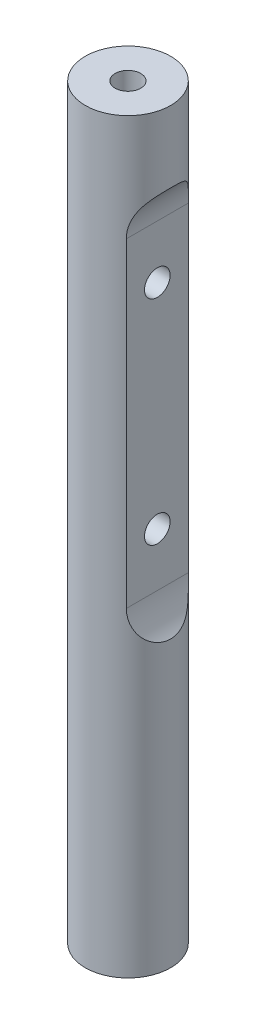
ISO-10303-21;
HEADER;
FILE_DESCRIPTION(('STEP AP214'),'2;1');
FILE_NAME('part.step','',(''),(''),'','','');
FILE_SCHEMA(('AUTOMOTIVE_DESIGN { 1 0 10303 214 1 1 1 1 }'));
ENDSEC;
DATA;
#1=APPLICATION_CONTEXT('core data for automotive mechanical design processes');
#2=APPLICATION_PROTOCOL_DEFINITION('international standard','automotive_design',2000,#1);
#3=PRODUCT_CONTEXT('',#1,'mechanical');
#4=PRODUCT('Part','Part','',(#3));
#5=PRODUCT_RELATED_PRODUCT_CATEGORY('part','',(#4));
#6=PRODUCT_DEFINITION_FORMATION('','',#4);
#7=PRODUCT_DEFINITION_CONTEXT('part definition',#1,'design');
#8=PRODUCT_DEFINITION('design','',#6,#7);
#9=PRODUCT_DEFINITION_SHAPE('','',#8);
#10=(LENGTH_UNIT() NAMED_UNIT(*) SI_UNIT(.MILLI.,.METRE.));
#11=(NAMED_UNIT(*) PLANE_ANGLE_UNIT() SI_UNIT($,.RADIAN.));
#12=(NAMED_UNIT(*) SI_UNIT($,.STERADIAN.) SOLID_ANGLE_UNIT());
#13=UNCERTAINTY_MEASURE_WITH_UNIT(LENGTH_MEASURE(1.E-05),#10,'distance_accuracy_value','');
#14=(GEOMETRIC_REPRESENTATION_CONTEXT(3) GLOBAL_UNCERTAINTY_ASSIGNED_CONTEXT((#13)) GLOBAL_UNIT_ASSIGNED_CONTEXT((#10,
#11,#12)) REPRESENTATION_CONTEXT('',''));
#15=CARTESIAN_POINT('',(0.,0.,0.));
#16=DIRECTION('',(0.,0.,1.));
#17=DIRECTION('',(1.,0.,0.));
#18=AXIS2_PLACEMENT_3D('',#15,#16,#17);
#19=CARTESIAN_POINT('',(0.,88.9,0.));
#20=DIRECTION('',(0.,-1.,0.));
#21=DIRECTION('',(0.,0.,-1.));
#22=AXIS2_PLACEMENT_3D('',#19,#20,#21);
#23=CYLINDRICAL_SURFACE('',#22,5.08);
#24=CARTESIAN_POINT('',(-5.08000000000001,68.326,0.));
#25=CARTESIAN_POINT('',(-5.07999928118559,68.3260010134447,-0.0836052305573521));
#26=CARTESIAN_POINT('',(-5.07791634345057,68.332902565442,-0.167220715445152));
#27=CARTESIAN_POINT('',(-5.0698105928319,68.3602608958897,-0.332016735309757));
#28=CARTESIAN_POINT('',(-5.06378660483927,68.3807217173517,-0.413196536482001));
#29=CARTESIAN_POINT('',(-5.04845881341866,68.4344539531808,-0.570720431078596));
#30=CARTESIAN_POINT('',(-5.03915985054432,68.4677064675329,-0.647071466225694));
#31=CARTESIAN_POINT('',(-5.01824862985448,68.5460006705448,-0.793114167949977));
#32=CARTESIAN_POINT('',(-5.0066360643514,68.5910439275138,-0.862804946949182));
#33=CARTESIAN_POINT('',(-4.98196348987859,68.6930035915922,-0.995549745938682));
#34=CARTESIAN_POINT('',(-4.96887381795549,68.7501968919001,-1.05838556038424));
#35=CARTESIAN_POINT('',(-4.9428992755781,68.8742429775888,-1.17373319658096));
#36=CARTESIAN_POINT('',(-4.93001443992094,68.941097385119,-1.22624328108679));
#37=CARTESIAN_POINT('',(-4.90559459817673,69.0844142850862,-1.32059718327286));
#38=CARTESIAN_POINT('',(-4.89409645170497,69.1610589963666,-1.36217465966568));
#39=CARTESIAN_POINT('',(-4.87419518320336,69.320653082298,-1.43176137091155));
#40=CARTESIAN_POINT('',(-4.86579131806324,69.4036009374308,-1.45977386398692));
#41=CARTESIAN_POINT('',(-4.8533392477185,69.5709965103886,-1.50064859821573));
#42=CARTESIAN_POINT('',(-4.84917566433726,69.6553371877658,-1.51391311374431));
#43=CARTESIAN_POINT('',(-4.84533234385764,69.8251416867163,-1.52617150304506));
#44=CARTESIAN_POINT('',(-4.84565152036741,69.910605231148,-1.52516883445255));
#45=CARTESIAN_POINT('',(-4.85063539972863,70.0769580511462,-1.50923728835008));
#46=CARTESIAN_POINT('',(-4.85514282816727,70.157901086368,-1.49481240546887));
#47=CARTESIAN_POINT('',(-4.86774089928282,70.3161609028539,-1.45326019153888));
#48=CARTESIAN_POINT('',(-4.87583189558469,70.3934773254123,-1.42613160687906));
#49=CARTESIAN_POINT('',(-4.89481096804173,70.5435219552553,-1.3595708308014));
#50=CARTESIAN_POINT('',(-4.90573584373808,70.6161727972985,-1.31997518005596));
#51=CARTESIAN_POINT('',(-4.92913402792066,70.7539677343624,-1.22971786150102));
#52=CARTESIAN_POINT('',(-4.94160771134943,70.8191100042844,-1.17905351186629));
#53=CARTESIAN_POINT('',(-4.96733587478704,70.9428971698142,-1.06559391417795));
#54=CARTESIAN_POINT('',(-4.98060120779466,71.0011571226541,-1.00238042598645));
#55=CARTESIAN_POINT('',(-5.00595639968271,71.1063388478093,-0.866915471462994));
#56=CARTESIAN_POINT('',(-5.01804618454705,71.153259906469,-0.794663436690661));
#57=CARTESIAN_POINT('',(-5.03979850630582,71.2346656812242,-0.642472718956282));
#58=CARTESIAN_POINT('',(-5.04944424367007,71.2690649965099,-0.562485793743911));
#59=CARTESIAN_POINT('',(-5.06510058181538,71.3238091835412,-0.397505342253167));
#60=CARTESIAN_POINT('',(-5.07111219645991,71.344157975389,-0.312513219615005));
#61=CARTESIAN_POINT('',(-5.07866258477835,71.3695826127458,-0.143207478551014));
#62=CARTESIAN_POINT('',(-5.08035408024475,71.3751801711744,-0.0589788991627962));
#63=CARTESIAN_POINT('',(-5.07952170013628,71.3724057377965,0.109219599516565));
#64=CARTESIAN_POINT('',(-5.07699838728601,71.3640356108341,0.193189551837839));
#65=CARTESIAN_POINT('',(-5.06811988138957,71.3339852351107,0.356518062994658));
#66=CARTESIAN_POINT('',(-5.06185251076207,71.3126098382178,0.435937936976004));
#67=CARTESIAN_POINT('',(-5.04621137406997,71.2575224754974,0.590046713177801));
#68=CARTESIAN_POINT('',(-5.03683723462222,71.2238090267855,0.664735045457996));
#69=CARTESIAN_POINT('',(-5.01568368820946,71.1441267838712,0.809180184492427));
#70=CARTESIAN_POINT('',(-5.0038536532295,71.0978925095968,0.87878292741886));
#71=CARTESIAN_POINT('',(-4.97914644264547,70.9948036498823,1.00941968090783));
#72=CARTESIAN_POINT('',(-4.96626900501977,70.9379464023221,1.07045153687363));
#73=CARTESIAN_POINT('',(-4.94033222619044,70.8127744946968,1.18451116463843));
#74=CARTESIAN_POINT('',(-4.927283262338,70.7441187342159,1.23716776931206));
#75=CARTESIAN_POINT('',(-4.90297739482279,70.5986620139623,1.33023858993307));
#76=CARTESIAN_POINT('',(-4.89172044417126,70.5218612678489,1.37065312690742));
#77=CARTESIAN_POINT('',(-4.87240264648896,70.3625389888852,1.43781624681202));
#78=CARTESIAN_POINT('',(-4.86432695249328,70.2800461944788,1.46462848488042));
#79=CARTESIAN_POINT('',(-4.85233059872599,70.1114290235656,1.50390078508155));
#80=CARTESIAN_POINT('',(-4.84840851508433,70.0253059020797,1.51636576562439));
#81=CARTESIAN_POINT('',(-4.84530372056024,69.8557286973298,1.52625536236819));
#82=CARTESIAN_POINT('',(-4.84593033801839,69.7723129305661,1.52428504193425));
#83=CARTESIAN_POINT('',(-4.85139391708907,69.6070600709732,1.5068042553193));
#84=CARTESIAN_POINT('',(-4.85623071010032,69.5252229150608,1.49129433134711));
#85=CARTESIAN_POINT('',(-4.86944175889112,69.3664394744709,1.44756519025001));
#86=CARTESIAN_POINT('',(-4.877771342187,69.2894450760405,1.41950618315181));
#87=CARTESIAN_POINT('',(-4.89702123371683,69.1411952821612,1.35160011235066));
#88=CARTESIAN_POINT('',(-4.90794203773421,69.069940988477,1.31175079242281));
#89=CARTESIAN_POINT('',(-4.93164039248647,68.9323862736085,1.21969544025952));
#90=CARTESIAN_POINT('',(-4.94447108806419,68.8663608585594,1.16709216510481));
#91=CARTESIAN_POINT('',(-4.97028541577226,68.7438782617192,1.05173713583857));
#92=CARTESIAN_POINT('',(-4.98326908677088,68.6874235703008,0.988982748608641));
#93=CARTESIAN_POINT('',(-5.0083815155578,68.5840402131083,0.852897214378164));
#94=CARTESIAN_POINT('',(-5.02047418321925,68.5374382899948,0.77931049196324));
#95=CARTESIAN_POINT('',(-5.04200851343106,68.4573330673775,0.624983635967253));
#96=CARTESIAN_POINT('',(-5.05145141529964,68.4238236415131,0.544246869846932));
#97=CARTESIAN_POINT('',(-5.0657980976881,68.3738583999368,0.386849836057765));
#98=CARTESIAN_POINT('',(-5.07107979819164,68.3559601403506,0.3106795533455));
#99=CARTESIAN_POINT('',(-5.07818079606404,68.3320314583546,0.15634227835447));
#100=CARTESIAN_POINT('',(-5.08000067213217,68.3259990523719,0.0781756220158688));
#101=CARTESIAN_POINT('',(-5.08000000000001,68.326,0.));
#102=B_SPLINE_CURVE_WITH_KNOTS('',3,(#24,#25,#26,#27,#28,#29,#30,#31,#32,#33,#34,#35,#36,#37,
#38,#39,#40,#41,#42,#43,#44,#45,#46,#47,#48,#49,#50,#51,#52,#53,#54,#55,#56,#57,#58,#59,#60,#61,
#62,#63,#64,#65,#66,#67,#68,#69,#70,#71,#72,#73,#74,#75,#76,#77,#78,#79,#80,#81,#82,#83,#84,#85,
#86,#87,#88,#89,#90,#91,#92,#93,#94,#95,#96,#97,#98,#99,#100,#101),.UNSPECIFIED.,.T.,.F.,(4,2,2,
2,2,2,2,2,2,2,2,2,2,2,2,2,2,2,2,2,2,2,2,2,2,2,2,2,2,2,2,2,2,2,2,2,2,2,4),(0.,0.25052853487041,
0.501131804283533,0.751366215121684,1.0016339270433,1.25837292595362,1.5151550828525,
1.77771024700173,2.04020231575914,2.29534404386304,2.55042393972194,2.79629632964838,
3.04219298756527,3.29145825270271,3.54078397921089,3.80052177712934,4.06027591835566,
4.32176983631793,4.58319076785267,4.8352335038956,5.08724259207129,5.33356054629242,
5.57990811467226,5.83195486594152,6.08406486512191,6.34533046727978,6.6065892176072,
6.86661379990468,7.12654921611644,7.37565357954409,7.6247479677618,7.8707492104916,
8.11679755913952,8.37180876490804,8.62688622495859,8.88942084095173,9.15183246180754,
9.38612999001342,9.62038834820051),.UNSPECIFIED.);
#103=CARTESIAN_POINT('',(-5.08000000000001,68.326,0.));
#104=VERTEX_POINT('',#103);
#105=EDGE_CURVE('E13',#104,#104,#102,.T.);
#106=ORIENTED_EDGE('',*,*,#105,.T.);
#107=EDGE_LOOP('',(#106));
#108=FACE_BOUND('',#107,.T.);
#109=CARTESIAN_POINT('',(-5.08000000000001,42.926,0.));
#110=CARTESIAN_POINT('',(-5.07999928118559,42.9260010134447,-0.0836052305573519));
#111=CARTESIAN_POINT('',(-5.07791634345057,42.932902565442,-0.167220715445152));
#112=CARTESIAN_POINT('',(-5.0698105928319,42.9602608958897,-0.332016735309756));
#113=CARTESIAN_POINT('',(-5.06378660483927,42.9807217173517,-0.413196536481999));
#114=CARTESIAN_POINT('',(-5.04845881341866,43.0344539531808,-0.570720431078596));
#115=CARTESIAN_POINT('',(-5.03915985054432,43.0677064675329,-0.647071466225696));
#116=CARTESIAN_POINT('',(-5.01824862985448,43.1460006705447,-0.793114167949977));
#117=CARTESIAN_POINT('',(-5.0066360643514,43.1910439275138,-0.862804946949177));
#118=CARTESIAN_POINT('',(-4.98196348987859,43.2930035915922,-0.995549745938677));
#119=CARTESIAN_POINT('',(-4.96887381795549,43.3501968919001,-1.05838556038424));
#120=CARTESIAN_POINT('',(-4.94289927557809,43.4742429775888,-1.17373319658096));
#121=CARTESIAN_POINT('',(-4.93001443992094,43.541097385119,-1.22624328108679));
#122=CARTESIAN_POINT('',(-4.90559459817673,43.6844142850862,-1.32059718327286));
#123=CARTESIAN_POINT('',(-4.89409645170497,43.7610589963666,-1.36217465966568));
#124=CARTESIAN_POINT('',(-4.87419518320336,43.920653082298,-1.43176137091156));
#125=CARTESIAN_POINT('',(-4.86579131806324,44.0036009374308,-1.45977386398692));
#126=CARTESIAN_POINT('',(-4.85333924771849,44.1709965103885,-1.50064859821573));
#127=CARTESIAN_POINT('',(-4.84917566433726,44.2553371877658,-1.51391311374431));
#128=CARTESIAN_POINT('',(-4.84533234385764,44.4251416867162,-1.52617150304506));
#129=CARTESIAN_POINT('',(-4.84565152036741,44.510605231148,-1.52516883445255));
#130=CARTESIAN_POINT('',(-4.85063539972862,44.6769580511462,-1.50923728835008));
#131=CARTESIAN_POINT('',(-4.85514282816727,44.757901086368,-1.49481240546887));
#132=CARTESIAN_POINT('',(-4.86774089928282,44.9161609028538,-1.45326019153888));
#133=CARTESIAN_POINT('',(-4.87583189558468,44.9934773254123,-1.42613160687906));
#134=CARTESIAN_POINT('',(-4.89481096804173,45.1435219552553,-1.3595708308014));
#135=CARTESIAN_POINT('',(-4.90573584373807,45.2161727972985,-1.31997518005596));
#136=CARTESIAN_POINT('',(-4.92913402792066,45.3539677343623,-1.22971786150102));
#137=CARTESIAN_POINT('',(-4.94160771134943,45.4191100042844,-1.1790535118663));
#138=CARTESIAN_POINT('',(-4.96733587478704,45.5428971698142,-1.06559391417795));
#139=CARTESIAN_POINT('',(-4.98060120779466,45.6011571226541,-1.00238042598644));
#140=CARTESIAN_POINT('',(-5.00595639968271,45.7063388478093,-0.866915471462987));
#141=CARTESIAN_POINT('',(-5.01804618454705,45.7532599064691,-0.79466343669066));
#142=CARTESIAN_POINT('',(-5.03979850630582,45.8346656812242,-0.642472718956287));
#143=CARTESIAN_POINT('',(-5.04944424367007,45.8690649965099,-0.562485793743917));
#144=CARTESIAN_POINT('',(-5.06510058181538,45.9238091835412,-0.397505342253176));
#145=CARTESIAN_POINT('',(-5.07111219645991,45.944157975389,-0.312513219615016));
#146=CARTESIAN_POINT('',(-5.07866258477835,45.9695826127458,-0.143207478551028));
#147=CARTESIAN_POINT('',(-5.08035408024475,45.9751801711744,-0.0589788991628086));
#148=CARTESIAN_POINT('',(-5.07952170013628,45.9724057377965,0.109219599516554));
#149=CARTESIAN_POINT('',(-5.07699838728601,45.9640356108341,0.193189551837829));
#150=CARTESIAN_POINT('',(-5.06811988138957,45.9339852351107,0.356518062994648));
#151=CARTESIAN_POINT('',(-5.06185251076207,45.9126098382178,0.435937936975993));
#152=CARTESIAN_POINT('',(-5.04621137406997,45.8575224754973,0.59004671317779));
#153=CARTESIAN_POINT('',(-5.03683723462222,45.8238090267855,0.664735045457988));
#154=CARTESIAN_POINT('',(-5.01568368820946,45.7441267838712,0.809180184492422));
#155=CARTESIAN_POINT('',(-5.0038536532295,45.6978925095969,0.878782927418856));
#156=CARTESIAN_POINT('',(-4.97914644264547,45.5948036498823,1.00941968090782));
#157=CARTESIAN_POINT('',(-4.96626900501977,45.5379464023221,1.07045153687362));
#158=CARTESIAN_POINT('',(-4.94033222619044,45.4127744946967,1.18451116463843));
#159=CARTESIAN_POINT('',(-4.927283262338,45.3441187342159,1.23716776931207));
#160=CARTESIAN_POINT('',(-4.90297739482279,45.1986620139622,1.33023858993307));
#161=CARTESIAN_POINT('',(-4.89172044417126,45.1218612678489,1.37065312690743));
#162=CARTESIAN_POINT('',(-4.87240264648896,44.9625389888852,1.43781624681202));
#163=CARTESIAN_POINT('',(-4.86432695249328,44.8800461944788,1.46462848488042));
#164=CARTESIAN_POINT('',(-4.85233059872599,44.7114290235656,1.50390078508155));
#165=CARTESIAN_POINT('',(-4.84840851508434,44.6253059020797,1.51636576562439));
#166=CARTESIAN_POINT('',(-4.84530372056025,44.4557286973298,1.52625536236819));
#167=CARTESIAN_POINT('',(-4.84593033801839,44.3723129305661,1.52428504193425));
#168=CARTESIAN_POINT('',(-4.85139391708907,44.2070600709732,1.50680425531929));
#169=CARTESIAN_POINT('',(-4.85623071010032,44.1252229150608,1.4912943313471));
#170=CARTESIAN_POINT('',(-4.86944175889112,43.9664394744709,1.44756519025001));
#171=CARTESIAN_POINT('',(-4.877771342187,43.8894450760405,1.41950618315181));
#172=CARTESIAN_POINT('',(-4.89702123371683,43.7411952821612,1.35160011235066));
#173=CARTESIAN_POINT('',(-4.90794203773421,43.669940988477,1.31175079242281));
#174=CARTESIAN_POINT('',(-4.93164039248646,43.5323862736085,1.21969544025952));
#175=CARTESIAN_POINT('',(-4.94447108806419,43.4663608585594,1.16709216510481));
#176=CARTESIAN_POINT('',(-4.97028541577226,43.3438782617192,1.05173713583858));
#177=CARTESIAN_POINT('',(-4.98326908677088,43.2874235703008,0.988982748608645));
#178=CARTESIAN_POINT('',(-5.00838151555779,43.1840402131083,0.852897214378173));
#179=CARTESIAN_POINT('',(-5.02047418321925,43.1374382899948,0.779310491963251));
#180=CARTESIAN_POINT('',(-5.04200851343106,43.0573330673775,0.624983635967263));
#181=CARTESIAN_POINT('',(-5.05145141529964,43.0238236415131,0.544246869846937));
#182=CARTESIAN_POINT('',(-5.0657980976881,42.9738583999368,0.386849836057765));
#183=CARTESIAN_POINT('',(-5.07107979819165,42.9559601403506,0.310679553345501));
#184=CARTESIAN_POINT('',(-5.07818079606404,42.9320314583546,0.156342278354471));
#185=CARTESIAN_POINT('',(-5.08000067213216,42.9259990523719,0.0781756220158694));
#186=CARTESIAN_POINT('',(-5.08000000000001,42.926,0.));
#187=B_SPLINE_CURVE_WITH_KNOTS('',3,(#109,#110,#111,#112,#113,#114,#115,#116,#117,#118,#119,
#120,#121,#122,#123,#124,#125,#126,#127,#128,#129,#130,#131,#132,#133,#134,#135,#136,#137,#138,
#139,#140,#141,#142,#143,#144,#145,#146,#147,#148,#149,#150,#151,#152,#153,#154,#155,#156,#157,
#158,#159,#160,#161,#162,#163,#164,#165,#166,#167,#168,#169,#170,#171,#172,#173,#174,#175,#176,
#177,#178,#179,#180,#181,#182,#183,#184,#185,#186),.UNSPECIFIED.,.T.,.F.,(4,2,2,2,2,2,2,2,2,2,2,
2,2,2,2,2,2,2,2,2,2,2,2,2,2,2,2,2,2,2,2,2,2,2,2,2,2,2,4),(0.,0.25052853487041,0.501131804283531,
0.751366215121685,1.0016339270433,1.25837292595362,1.5151550828525,1.77771024700174,
2.04020231575913,2.29534404386303,2.55042393972193,2.79629632964837,3.04219298756527,
3.29145825270271,3.54078397921089,3.80052177712935,4.06027591835566,4.32176983631793,
4.58319076785265,4.83523350389558,5.08724259207129,5.33356054629241,5.57990811467224,
5.83195486594151,6.0840648651219,6.3453304672798,6.60658921760719,6.86661379990468,
7.12654921611643,7.3756535795441,7.62474796776181,7.87074921049159,8.11679755913952,
8.37180876490804,8.62688622495857,8.88942084095171,9.15183246180753,9.38612999001341,
9.6203883482005),.UNSPECIFIED.);
#188=CARTESIAN_POINT('',(-5.08000000000001,42.926,0.));
#189=VERTEX_POINT('',#188);
#190=EDGE_CURVE('E62',#189,#189,#187,.T.);
#191=ORIENTED_EDGE('',*,*,#190,.T.);
#192=EDGE_LOOP('',(#191));
#193=FACE_BOUND('',#192,.T.);
#194=CARTESIAN_POINT('',(0.,0.,0.));
#195=DIRECTION('',(0.,1.,0.));
#196=DIRECTION('',(0.,0.,1.));
#197=AXIS2_PLACEMENT_3D('',#194,#195,#196);
#198=CIRCLE('',#197,5.08);
#199=CARTESIAN_POINT('',(0.,0.,5.08));
#200=VERTEX_POINT('',#199);
#201=EDGE_CURVE('E161',#200,#200,#198,.T.);
#202=ORIENTED_EDGE('',*,*,#201,.T.);
#203=EDGE_LOOP('',(#202));
#204=FACE_BOUND('',#203,.T.);
#205=CARTESIAN_POINT('',(0.,88.9,0.));
#206=DIRECTION('',(0.,1.,0.));
#207=DIRECTION('',(0.,0.,1.));
#208=AXIS2_PLACEMENT_3D('',#205,#206,#207);
#209=CIRCLE('',#208,5.08);
#210=CARTESIAN_POINT('',(0.,88.9,5.08));
#211=VERTEX_POINT('',#210);
#212=EDGE_CURVE('E91',#211,#211,#209,.T.);
#213=ORIENTED_EDGE('',*,*,#212,.F.);
#214=EDGE_LOOP('',(#213));
#215=FACE_BOUND('',#214,.T.);
#216=CARTESIAN_POINT('',(3.4925,38.1,3.68901663726256));
#217=CARTESIAN_POINT('',(3.49248002010246,37.9779684983372,3.68899434683154));
#218=CARTESIAN_POINT('',(3.49601699210803,37.8559317980734,3.68568549951045));
#219=CARTESIAN_POINT('',(3.51006535485599,37.6125990551638,3.67233123001832));
#220=CARTESIAN_POINT('',(3.52057860595572,37.4913032187932,3.6622840109248));
#221=CARTESIAN_POINT('',(3.54850047058183,37.2497452141904,3.6352306912495));
#222=CARTESIAN_POINT('',(3.56593886542265,37.1294898331607,3.61819452437162));
#223=CARTESIAN_POINT('',(3.60740861825911,36.8913930721754,3.57685140164994));
#224=CARTESIAN_POINT('',(3.63143950303185,36.7735515196023,3.55254496767001));
#225=CARTESIAN_POINT('',(3.68572606694843,36.5408512107284,3.49619165828006));
#226=CARTESIAN_POINT('',(3.71599769324276,36.4260009621964,3.4641249154837));
#227=CARTESIAN_POINT('',(3.78210520760592,36.2005498503639,3.39182526613429));
#228=CARTESIAN_POINT('',(3.81794064036449,36.0899486402692,3.35159302771625));
#229=CARTESIAN_POINT('',(3.89428416220474,35.8741743407115,3.26257272569786));
#230=CARTESIAN_POINT('',(3.93478349094456,35.7689915947761,3.21380061589724));
#231=CARTESIAN_POINT('',(4.01946434815094,35.5648545091605,3.10723895982833));
#232=CARTESIAN_POINT('',(4.06364550901865,35.4658995494175,3.04945031328134));
#233=CARTESIAN_POINT('',(4.15163203129862,35.2810730270066,2.92841200276997));
#234=CARTESIAN_POINT('',(4.19529391750769,35.1947712021983,2.86571547651936));
#235=CARTESIAN_POINT('',(4.28352459699651,35.0293191165464,2.73207306974154));
#236=CARTESIAN_POINT('',(4.32809325521431,34.9501678000655,2.66112841044353));
#237=CARTESIAN_POINT('',(4.41679470014537,34.7997199180533,2.51115683415549));
#238=CARTESIAN_POINT('',(4.46092764529205,34.7284203939189,2.43213298324817));
#239=CARTESIAN_POINT('',(4.5473869156324,34.5941972523549,2.26636345455124));
#240=CARTESIAN_POINT('',(4.58971348034978,34.5312725220796,2.17961880526565));
#241=CARTESIAN_POINT('',(4.66597656494355,34.4216883527399,2.01060334865437));
#242=CARTESIAN_POINT('',(4.70029328934269,34.3739779002837,1.92918287213759));
#243=CARTESIAN_POINT('',(4.76567796850873,34.2853688407207,1.76147941895235));
#244=CARTESIAN_POINT('',(4.79674620938263,34.2444696335319,1.67519687153784));
#245=CARTESIAN_POINT('',(4.85487731673975,34.1695585881304,1.49840727989453));
#246=CARTESIAN_POINT('',(4.88194053400598,34.135546146639,1.40790060655343));
#247=CARTESIAN_POINT('',(4.93142160689446,34.0744121776143,1.22335831107777));
#248=CARTESIAN_POINT('',(4.95383953430798,34.0472905435847,1.12932274350753));
#249=CARTESIAN_POINT('',(4.99237878046166,34.0012596199339,0.943928784273773));
#250=CARTESIAN_POINT('',(5.00878646847974,33.9819699363696,0.852723957656833));
#251=CARTESIAN_POINT('',(5.03668877855218,33.9494411550742,0.668468686853424));
#252=CARTESIAN_POINT('',(5.04818177508254,33.9362040591237,0.575417642665918));
#253=CARTESIAN_POINT('',(5.06601748362316,33.9157558602437,0.388207469405466));
#254=CARTESIAN_POINT('',(5.07236234882509,33.9085422379762,0.2940488203195));
#255=CARTESIAN_POINT('',(5.07978929859174,33.9001049337951,0.105221675713226));
#256=CARTESIAN_POINT('',(5.08086943225363,33.89888347234,0.0105530042056567));
#257=CARTESIAN_POINT('',(5.0777452480888,33.9024271809663,-0.178326191269714));
#258=CARTESIAN_POINT('',(5.07355533878085,33.9071760279571,-0.272537260534924));
#259=CARTESIAN_POINT('',(5.05999308206518,33.9226523649694,-0.460126648395613));
#260=CARTESIAN_POINT('',(5.0506188337251,33.9333820479847,-0.55350464876217));
#261=CARTESIAN_POINT('',(5.02687316700223,33.9608494701557,-0.738685344048326));
#262=CARTESIAN_POINT('',(5.01250401695501,33.9775844822216,-0.830488734221502));
#263=CARTESIAN_POINT('',(4.97904493989152,34.017111935655,-1.0119415749284));
#264=CARTESIAN_POINT('',(4.95995329191027,34.0399065854924,-1.10159022713997));
#265=CARTESIAN_POINT('',(4.9174531575804,34.0915676042718,-1.27799835834299));
#266=CARTESIAN_POINT('',(4.89404773845387,34.1204296611407,-1.36475983877751));
#267=CARTESIAN_POINT('',(4.84338875774374,34.1842565173886,-1.53488332629156));
#268=CARTESIAN_POINT('',(4.81613380250331,34.2192235280461,-1.61824408805156));
#269=CARTESIAN_POINT('',(4.75837383590255,34.2952092052174,-1.78093279588234));
#270=CARTESIAN_POINT('',(4.72787056116598,34.3362246425764,-1.86026286367374));
#271=CARTESIAN_POINT('',(4.66426259747171,34.4242261645108,-2.01445451214799));
#272=CARTESIAN_POINT('',(4.63115695710554,34.4712144366272,-2.08931444081068));
#273=CARTESIAN_POINT('',(4.52883979435764,34.6211888144077,-2.30686871074253));
#274=CARTESIAN_POINT('',(4.45673345508036,34.7330514219671,-2.44225096977255));
#275=CARTESIAN_POINT('',(4.31111608724529,34.9780483723542,-2.69101450492152));
#276=CARTESIAN_POINT('',(4.23760486068993,35.1111857332926,-2.80439265439934));
#277=CARTESIAN_POINT('',(4.09149391081804,35.4025533915976,-3.01383326781392));
#278=CARTESIAN_POINT('',(4.01911242230822,35.5616892004926,-3.1087853216842));
#279=CARTESIAN_POINT('',(3.88461743404587,35.8957720413072,-3.27530853847656));
#280=CARTESIAN_POINT('',(3.82251141022207,36.0707304430916,-3.34686271487384));
#281=CARTESIAN_POINT('',(3.70625587466038,36.4527946507853,-3.47540664517467));
#282=CARTESIAN_POINT('',(3.65382305138529,36.6612906184652,-3.52980262397758));
#283=CARTESIAN_POINT('',(3.57004953464807,37.0871173279033,-3.61451433919406));
#284=CARTESIAN_POINT('',(3.5386997027269,37.304444198518,-3.64484050973615));
#285=CARTESIAN_POINT('',(3.50998973376064,37.6192749493296,-3.67239414137797));
#286=CARTESIAN_POINT('',(3.50343082091988,37.7153062597603,-3.67864332101859));
#287=CARTESIAN_POINT('',(3.494690023345,37.9075478585633,-3.68694590869129));
#288=CARTESIAN_POINT('',(3.49249903124456,38.0037573549942,-3.68900804711191));
#289=CARTESIAN_POINT('',(3.4925,38.1,-3.68901663726256));
#290=B_SPLINE_CURVE_WITH_KNOTS('',3,(#216,#217,#218,#219,#220,#221,#222,#223,#224,#225,#226,
#227,#228,#229,#230,#231,#232,#233,#234,#235,#236,#237,#238,#239,#240,#241,#242,#243,#244,#245,
#246,#247,#248,#249,#250,#251,#252,#253,#254,#255,#256,#257,#258,#259,#260,#261,#262,#263,#264,
#265,#266,#267,#268,#269,#270,#271,#272,#273,#274,#275,#276,#277,#278,#279,#280,#281,#282,#283,
#284,#285,#286,#287,#288,#289),.UNSPECIFIED.,.F.,.F.,(4,2,2,2,2,2,2,2,2,2,2,2,2,2,2,2,2,2,2,2,2,
2,2,2,2,2,2,2,2,2,2,2,2,2,2,2,4),(0.,0.366007040088944,0.732111722152313,1.09980817532662,
1.46747824137392,1.83609973722632,2.20469108307769,2.57260105034067,2.94047432890635,
3.28576105653329,3.63099672551341,3.97610185923857,4.32116108938159,4.62201854124508,
4.92284947302438,5.22365404068469,5.52445395917305,5.80808427497752,6.0918083284975,
6.37541365395915,6.65912406443462,6.94206048208876,7.22510071238351,7.50801257313179,
7.79102768443919,8.07384233435817,8.35675963604697,8.63952643607594,8.92239709900421,
9.4891252115866,10.0559337936908,10.6503107348614,11.2451182320942,11.9078014332267,
12.5701972077249,12.859414865934,13.1480288553147),.UNSPECIFIED.);
#291=CARTESIAN_POINT('',(3.49250000000001,38.1,3.68901663726256));
#292=VERTEX_POINT('',#291);
#293=CARTESIAN_POINT('',(3.49250000000001,38.1,-3.68901663726256));
#294=VERTEX_POINT('',#293);
#295=EDGE_CURVE('E102',#292,#294,#290,.T.);
#296=ORIENTED_EDGE('',*,*,#295,.F.);
#297=DIRECTION('',(0.,-1.,0.));
#298=VECTOR('',#297,1.);
#299=CARTESIAN_POINT('',(3.4925,88.9,3.68901663726257));
#300=LINE('',#299,#298);
#301=CARTESIAN_POINT('',(3.4925,76.2,3.68901663726257));
#302=VERTEX_POINT('',#301);
#303=EDGE_CURVE('E97',#302,#292,#300,.T.);
#304=ORIENTED_EDGE('',*,*,#303,.F.);
#305=CARTESIAN_POINT('',(3.4925,76.2,-3.68901663726257));
#306=CARTESIAN_POINT('',(3.49248002010246,76.3220315016628,-3.68899434683155));
#307=CARTESIAN_POINT('',(3.49601699210803,76.4440682019266,-3.68568549951046));
#308=CARTESIAN_POINT('',(3.51006535485599,76.6874009448362,-3.67233123001833));
#309=CARTESIAN_POINT('',(3.52057860595572,76.8086967812068,-3.6622840109248));
#310=CARTESIAN_POINT('',(3.54850047058182,77.0502547858097,-3.63523069124951));
#311=CARTESIAN_POINT('',(3.56593886542265,77.1705101668393,-3.61819452437163));
#312=CARTESIAN_POINT('',(3.60740861825911,77.4086069278246,-3.57685140164995));
#313=CARTESIAN_POINT('',(3.63143950303185,77.5264484803977,-3.55254496767002));
#314=CARTESIAN_POINT('',(3.68572606694842,77.7591487892716,-3.49619165828007));
#315=CARTESIAN_POINT('',(3.71599769324275,77.8739990378036,-3.4641249154837));
#316=CARTESIAN_POINT('',(3.78210520760591,78.0994501496361,-3.3918252661343));
#317=CARTESIAN_POINT('',(3.81794064036448,78.2100513597308,-3.35159302771626));
#318=CARTESIAN_POINT('',(3.89428416220473,78.4258256592885,-3.26257272569786));
#319=CARTESIAN_POINT('',(3.93478349094455,78.5310084052239,-3.21380061589725));
#320=CARTESIAN_POINT('',(4.01946434815094,78.7351454908395,-3.10723895982834));
#321=CARTESIAN_POINT('',(4.06364550901864,78.8341004505825,-3.04945031328136));
#322=CARTESIAN_POINT('',(4.15163203129861,79.0189269729934,-2.92841200276998));
#323=CARTESIAN_POINT('',(4.19529391750768,79.1052287978017,-2.86571547651937));
#324=CARTESIAN_POINT('',(4.28352459699651,79.2706808834536,-2.73207306974154));
#325=CARTESIAN_POINT('',(4.3280932552143,79.3498321999345,-2.66112841044353));
#326=CARTESIAN_POINT('',(4.41679470014536,79.5002800819467,-2.5111568341555));
#327=CARTESIAN_POINT('',(4.46092764529204,79.5715796060811,-2.43213298324818));
#328=CARTESIAN_POINT('',(4.5473869156324,79.7058027476451,-2.26636345455125));
#329=CARTESIAN_POINT('',(4.58971348034978,79.7687274779204,-2.17961880526565));
#330=CARTESIAN_POINT('',(4.66597656494355,79.8783116472601,-2.01060334865437));
#331=CARTESIAN_POINT('',(4.70029328934269,79.9260220997163,-1.92918287213759));
#332=CARTESIAN_POINT('',(4.76567796850873,80.0146311592793,-1.76147941895235));
#333=CARTESIAN_POINT('',(4.79674620938263,80.0555303664681,-1.67519687153784));
#334=CARTESIAN_POINT('',(4.85487731673974,80.1304414118696,-1.49840727989453));
#335=CARTESIAN_POINT('',(4.88194053400598,80.164453853361,-1.40790060655343));
#336=CARTESIAN_POINT('',(4.93142160689446,80.2255878223857,-1.22335831107778));
#337=CARTESIAN_POINT('',(4.95383953430797,80.2527094564154,-1.12932274350754));
#338=CARTESIAN_POINT('',(4.99237878046166,80.2987403800661,-0.943928784273786));
#339=CARTESIAN_POINT('',(5.00878646847974,80.3180300636304,-0.852723957656844));
#340=CARTESIAN_POINT('',(5.03668877855218,80.3505588449258,-0.668468686853434));
#341=CARTESIAN_POINT('',(5.04818177508254,80.3637959408763,-0.575417642665927));
#342=CARTESIAN_POINT('',(5.06601748362316,80.3842441397563,-0.388207469405474));
#343=CARTESIAN_POINT('',(5.07236234882509,80.3914577620238,-0.294048820319507));
#344=CARTESIAN_POINT('',(5.07978929859173,80.3998950662049,-0.105221675713231));
#345=CARTESIAN_POINT('',(5.08086943225363,80.40111652766,-0.0105530042056608));
#346=CARTESIAN_POINT('',(5.0777452480888,80.3975728190338,0.178326191269711));
#347=CARTESIAN_POINT('',(5.07355533878085,80.3928239720429,0.272537260534921));
#348=CARTESIAN_POINT('',(5.05999308206518,80.3773476350306,0.46012664839561));
#349=CARTESIAN_POINT('',(5.0506188337251,80.3666179520153,0.553504648762167));
#350=CARTESIAN_POINT('',(5.02687316700223,80.3391505298443,0.738685344048323));
#351=CARTESIAN_POINT('',(5.01250401695501,80.3224155177784,0.8304887342215));
#352=CARTESIAN_POINT('',(4.97904493989152,80.282888064345,1.0119415749284));
#353=CARTESIAN_POINT('',(4.95995329191027,80.2600934145076,1.10159022713997));
#354=CARTESIAN_POINT('',(4.9174531575804,80.2084323957282,1.27799835834299));
#355=CARTESIAN_POINT('',(4.89404773845387,80.1795703388593,1.36475983877751));
#356=CARTESIAN_POINT('',(4.84338875774374,80.1157434826114,1.53488332629155));
#357=CARTESIAN_POINT('',(4.81613380250331,80.0807764719539,1.61824408805156));
#358=CARTESIAN_POINT('',(4.75837383590255,80.0047907947826,1.78093279588234));
#359=CARTESIAN_POINT('',(4.72787056116598,79.9637753574236,1.86026286367374));
#360=CARTESIAN_POINT('',(4.66426259747171,79.8757738354893,2.01445451214799));
#361=CARTESIAN_POINT('',(4.63115695710554,79.8287855633728,2.08931444081068));
#362=CARTESIAN_POINT('',(4.52883979435764,79.6788111855923,2.30686871074253));
#363=CARTESIAN_POINT('',(4.45673345508036,79.5669485780329,2.44225096977255));
#364=CARTESIAN_POINT('',(4.31111608724529,79.3219516276459,2.69101450492152));
#365=CARTESIAN_POINT('',(4.23760486068993,79.1888142667074,2.80439265439934));
#366=CARTESIAN_POINT('',(4.09149391081804,78.8974466084024,3.01383326781392));
#367=CARTESIAN_POINT('',(4.01911242230822,78.7383107995074,3.1087853216842));
#368=CARTESIAN_POINT('',(3.88461743404587,78.4042279586928,3.27530853847657));
#369=CARTESIAN_POINT('',(3.82251141022206,78.2292695569084,3.34686271487384));
#370=CARTESIAN_POINT('',(3.70625587466038,77.8472053492147,3.47540664517468));
#371=CARTESIAN_POINT('',(3.65382305138529,77.6387093815348,3.52980262397759));
#372=CARTESIAN_POINT('',(3.57004953464806,77.2128826720968,3.61451433919406));
#373=CARTESIAN_POINT('',(3.53869970272689,76.995555801482,3.64484050973615));
#374=CARTESIAN_POINT('',(3.50998973376063,76.6807250506704,3.67239414137797));
#375=CARTESIAN_POINT('',(3.50343082091987,76.5846937402397,3.67864332101859));
#376=CARTESIAN_POINT('',(3.49469002334499,76.3924521414367,3.6869459086913));
#377=CARTESIAN_POINT('',(3.49249903124456,76.2962426450058,3.68900804711191));
#378=CARTESIAN_POINT('',(3.4925,76.2,3.68901663726257));
#379=B_SPLINE_CURVE_WITH_KNOTS('',3,(#305,#306,#307,#308,#309,#310,#311,#312,#313,#314,#315,
#316,#317,#318,#319,#320,#321,#322,#323,#324,#325,#326,#327,#328,#329,#330,#331,#332,#333,#334,
#335,#336,#337,#338,#339,#340,#341,#342,#343,#344,#345,#346,#347,#348,#349,#350,#351,#352,#353,
#354,#355,#356,#357,#358,#359,#360,#361,#362,#363,#364,#365,#366,#367,#368,#369,#370,#371,#372,
#373,#374,#375,#376,#377,#378),.UNSPECIFIED.,.F.,.F.,(4,2,2,2,2,2,2,2,2,2,2,2,2,2,2,2,2,2,2,2,2,
2,2,2,2,2,2,2,2,2,2,2,2,2,2,2,4),(0.,0.366007040088958,0.73211172215232,1.09980817532662,
1.46747824137392,1.83609973722633,2.20469108307768,2.57260105034066,2.94047432890635,
3.2857610565333,3.63099672551342,3.97610185923858,4.3211610893816,4.62201854124509,
4.92284947302439,5.2236540406847,5.52445395917305,5.80808427497752,6.0918083284975,
6.37541365395916,6.65912406443463,6.94206048208877,7.22510071238352,7.5080125731318,
7.7910276844392,8.07384233435818,8.35675963604698,8.63952643607595,8.92239709900422,
9.48912521158661,10.0559337936908,10.6503107348614,11.2451182320942,11.9078014332267,
12.5701972077249,12.859414865934,13.1480288553147),.UNSPECIFIED.);
#380=CARTESIAN_POINT('',(3.4925,76.2,-3.68901663726257));
#381=VERTEX_POINT('',#380);
#382=EDGE_CURVE('E82',#381,#302,#379,.T.);
#383=ORIENTED_EDGE('',*,*,#382,.F.);
#384=DIRECTION('',(0.,-1.,0.));
#385=VECTOR('',#384,1.);
#386=CARTESIAN_POINT('',(3.4925,88.9,-3.68901663726257));
#387=LINE('',#386,#385);
#388=EDGE_CURVE('E90',#294,#381,#387,.F.);
#389=ORIENTED_EDGE('',*,*,#388,.F.);
#390=EDGE_LOOP('',(#296,#304,#383,#389));
#391=FACE_BOUND('',#390,.T.);
#392=ADVANCED_FACE('F50',(#108,#193,#204,#215,#391),#23,.T.);
#393=CARTESIAN_POINT('',(0.,88.9,0.));
#394=DIRECTION('',(0.,1.,0.));
#395=DIRECTION('',(0.,0.,1.));
#396=AXIS2_PLACEMENT_3D('',#393,#394,#395);
#397=PLANE('',#396);
#398=CARTESIAN_POINT('',(0.,88.9,0.));
#399=DIRECTION('',(0.,1.,0.));
#400=DIRECTION('',(0.,0.,1.));
#401=AXIS2_PLACEMENT_3D('',#398,#399,#400);
#402=CIRCLE('',#401,1.52399999999999);
#403=CARTESIAN_POINT('',(0.,88.9,1.52399999999999));
#404=VERTEX_POINT('',#403);
#405=EDGE_CURVE('E175',#404,#404,#402,.T.);
#406=ORIENTED_EDGE('',*,*,#405,.F.);
#407=EDGE_LOOP('',(#406));
#408=FACE_BOUND('',#407,.T.);
#409=ORIENTED_EDGE('',*,*,#212,.T.);
#410=EDGE_LOOP('',(#409));
#411=FACE_BOUND('',#410,.T.);
#412=ADVANCED_FACE('F140',(#408,#411),#397,.T.);
#413=CARTESIAN_POINT('',(0.,0.,0.));
#414=DIRECTION('',(0.,1.,0.));
#415=DIRECTION('',(0.,0.,1.));
#416=AXIS2_PLACEMENT_3D('',#413,#414,#415);
#417=PLANE('',#416);
#418=CARTESIAN_POINT('',(0.,0.,0.));
#419=DIRECTION('',(0.,-1.,0.));
#420=DIRECTION('',(0.,0.,-1.));
#421=AXIS2_PLACEMENT_3D('',#418,#419,#420);
#422=CIRCLE('',#421,1.52399999999999);
#423=CARTESIAN_POINT('',(0.,0.,-1.52399999999999));
#424=VERTEX_POINT('',#423);
#425=EDGE_CURVE('E181',#424,#424,#422,.T.);
#426=ORIENTED_EDGE('',*,*,#425,.F.);
#427=EDGE_LOOP('',(#426));
#428=FACE_BOUND('',#427,.T.);
#429=ORIENTED_EDGE('',*,*,#201,.F.);
#430=EDGE_LOOP('',(#429));
#431=FACE_BOUND('',#430,.T.);
#432=ADVANCED_FACE('F139',(#428,#431),#417,.F.);
#433=CARTESIAN_POINT('',(0.,80.772,0.));
#434=DIRECTION('',(0.,1.,0.));
#435=DIRECTION('',(0.,0.,1.));
#436=AXIS2_PLACEMENT_3D('',#433,#434,#435);
#437=CONICAL_SURFACE('',#436,1.524,1.02974425867665);
#438=CARTESIAN_POINT('',(0.,79.856288416602,0.));
#439=VERTEX_POINT('',#438);
#440=VERTEX_LOOP('',#439);
#441=FACE_BOUND('',#440,.T.);
#442=CARTESIAN_POINT('',(0.,80.772,0.));
#443=DIRECTION('',(0.,1.,0.));
#444=DIRECTION('',(0.,0.,1.));
#445=AXIS2_PLACEMENT_3D('',#442,#443,#444);
#446=CIRCLE('',#445,1.524);
#447=CARTESIAN_POINT('',(0.,80.772,1.524));
#448=VERTEX_POINT('',#447);
#449=EDGE_CURVE('E166',#448,#448,#446,.T.);
#450=ORIENTED_EDGE('',*,*,#449,.T.);
#451=EDGE_LOOP('',(#450));
#452=FACE_BOUND('',#451,.T.);
#453=ADVANCED_FACE('F135',(#441,#452),#437,.F.);
#454=CARTESIAN_POINT('',(0.,88.9,0.));
#455=DIRECTION('',(0.,1.,0.));
#456=DIRECTION('',(0.,0.,1.));
#457=AXIS2_PLACEMENT_3D('',#454,#455,#456);
#458=CYLINDRICAL_SURFACE('',#457,1.52399999999999);
#459=ORIENTED_EDGE('',*,*,#449,.F.);
#460=EDGE_LOOP('',(#459));
#461=FACE_BOUND('',#460,.T.);
#462=ORIENTED_EDGE('',*,*,#405,.T.);
#463=EDGE_LOOP('',(#462));
#464=FACE_BOUND('',#463,.T.);
#465=ADVANCED_FACE('F132',(#461,#464),#458,.F.);
#466=CARTESIAN_POINT('',(0.,8.128,0.));
#467=DIRECTION('',(0.,-1.,0.));
#468=DIRECTION('',(0.,0.,-1.));
#469=AXIS2_PLACEMENT_3D('',#466,#467,#468);
#470=CONICAL_SURFACE('',#469,1.524,1.02974425867665);
#471=CARTESIAN_POINT('',(0.,9.043711583398,0.));
#472=VERTEX_POINT('',#471);
#473=VERTEX_LOOP('',#472);
#474=FACE_BOUND('',#473,.T.);
#475=CARTESIAN_POINT('',(0.,8.128,0.));
#476=DIRECTION('',(0.,-1.,0.));
#477=DIRECTION('',(0.,0.,-1.));
#478=AXIS2_PLACEMENT_3D('',#475,#476,#477);
#479=CIRCLE('',#478,1.524);
#480=CARTESIAN_POINT('',(0.,8.128,-1.524));
#481=VERTEX_POINT('',#480);
#482=EDGE_CURVE('E178',#481,#481,#479,.T.);
#483=ORIENTED_EDGE('',*,*,#482,.T.);
#484=EDGE_LOOP('',(#483));
#485=FACE_BOUND('',#484,.T.);
#486=ADVANCED_FACE('F128',(#474,#485),#470,.F.);
#487=CARTESIAN_POINT('',(0.,0.,0.));
#488=DIRECTION('',(0.,-1.,0.));
#489=DIRECTION('',(0.,0.,-1.));
#490=AXIS2_PLACEMENT_3D('',#487,#488,#489);
#491=CYLINDRICAL_SURFACE('',#490,1.52399999999999);
#492=ORIENTED_EDGE('',*,*,#482,.F.);
#493=EDGE_LOOP('',(#492));
#494=FACE_BOUND('',#493,.T.);
#495=ORIENTED_EDGE('',*,*,#425,.T.);
#496=EDGE_LOOP('',(#495));
#497=FACE_BOUND('',#496,.T.);
#498=ADVANCED_FACE('F124',(#494,#497),#491,.F.);
#499=CARTESIAN_POINT('',(3.49250000000001,0.,5.08));
#500=DIRECTION('',(1.,0.,0.));
#501=DIRECTION('',(0.,1.,0.));
#502=AXIS2_PLACEMENT_3D('',#499,#500,#501);
#503=PLANE('',#502);
#504=CARTESIAN_POINT('',(3.4925,69.85,0.));
#505=DIRECTION('',(1.,0.,0.));
#506=DIRECTION('',(0.,0.,-1.));
#507=AXIS2_PLACEMENT_3D('',#504,#505,#506);
#508=CIRCLE('',#507,1.52399999999998);
#509=CARTESIAN_POINT('',(3.4925,69.85,-1.52399999999998));
#510=VERTEX_POINT('',#509);
#511=EDGE_CURVE('E187',#510,#510,#508,.T.);
#512=ORIENTED_EDGE('',*,*,#511,.F.);
#513=EDGE_LOOP('',(#512));
#514=FACE_BOUND('',#513,.T.);
#515=CARTESIAN_POINT('',(3.49250000000001,44.45,0.));
#516=DIRECTION('',(1.,0.,0.));
#517=DIRECTION('',(0.,0.,-1.));
#518=AXIS2_PLACEMENT_3D('',#515,#516,#517);
#519=CIRCLE('',#518,1.52399999999998);
#520=CARTESIAN_POINT('',(3.49250000000001,44.45,-1.52399999999998));
#521=VERTEX_POINT('',#520);
#522=EDGE_CURVE('E100',#521,#521,#519,.T.);
#523=ORIENTED_EDGE('',*,*,#522,.F.);
#524=EDGE_LOOP('',(#523));
#525=FACE_BOUND('',#524,.T.);
#526=ORIENTED_EDGE('',*,*,#303,.T.);
#527=DIRECTION('',(0.,0.,-1.));
#528=VECTOR('',#527,1.);
#529=CARTESIAN_POINT('',(3.49250000000001,38.1,5.08));
#530=LINE('',#529,#528);
#531=EDGE_CURVE('E99',#292,#294,#530,.T.);
#532=ORIENTED_EDGE('',*,*,#531,.T.);
#533=ORIENTED_EDGE('',*,*,#388,.T.);
#534=DIRECTION('',(0.,0.,-1.));
#535=VECTOR('',#534,1.);
#536=CARTESIAN_POINT('',(3.4925,76.2,5.08));
#537=LINE('',#536,#535);
#538=EDGE_CURVE('E85',#302,#381,#537,.T.);
#539=ORIENTED_EDGE('',*,*,#538,.F.);
#540=EDGE_LOOP('',(#526,#532,#533,#539));
#541=FACE_BOUND('',#540,.T.);
#542=ADVANCED_FACE('F95',(#514,#525,#541),#503,.T.);
#543=CARTESIAN_POINT('',(9.8425,38.1,5.08));
#544=DIRECTION('',(0.,0.,-1.));
#545=DIRECTION('',(-1.,0.,0.));
#546=AXIS2_PLACEMENT_3D('',#543,#544,#545);
#547=CYLINDRICAL_SURFACE('',#546,6.35);
#548=ORIENTED_EDGE('',*,*,#531,.F.);
#549=ORIENTED_EDGE('',*,*,#295,.T.);
#550=EDGE_LOOP('',(#548,#549));
#551=FACE_BOUND('',#550,.T.);
#552=ADVANCED_FACE('F115',(#551),#547,.F.);
#553=CARTESIAN_POINT('',(9.8425,76.2,5.08));
#554=DIRECTION('',(0.,0.,-1.));
#555=DIRECTION('',(-1.,0.,0.));
#556=AXIS2_PLACEMENT_3D('',#553,#554,#555);
#557=CYLINDRICAL_SURFACE('',#556,6.35);
#558=ORIENTED_EDGE('',*,*,#538,.T.);
#559=ORIENTED_EDGE('',*,*,#382,.T.);
#560=EDGE_LOOP('',(#558,#559));
#561=FACE_BOUND('',#560,.T.);
#562=ADVANCED_FACE('F84',(#561),#557,.F.);
#563=CARTESIAN_POINT('',(3.4925,44.45,0.));
#564=DIRECTION('',(1.,0.,0.));
#565=DIRECTION('',(0.,0.,-1.));
#566=AXIS2_PLACEMENT_3D('',#563,#564,#565);
#567=CYLINDRICAL_SURFACE('',#566,1.52399999999999);
#568=ORIENTED_EDGE('',*,*,#522,.T.);
#569=EDGE_LOOP('',(#568));
#570=FACE_BOUND('',#569,.T.);
#571=ORIENTED_EDGE('',*,*,#190,.F.);
#572=EDGE_LOOP('',(#571));
#573=FACE_BOUND('',#572,.T.);
#574=ADVANCED_FACE('F196',(#570,#573),#567,.F.);
#575=CARTESIAN_POINT('',(3.4925,69.85,0.));
#576=DIRECTION('',(1.,0.,0.));
#577=DIRECTION('',(0.,0.,-1.));
#578=AXIS2_PLACEMENT_3D('',#575,#576,#577);
#579=CYLINDRICAL_SURFACE('',#578,1.52399999999999);
#580=ORIENTED_EDGE('',*,*,#511,.T.);
#581=EDGE_LOOP('',(#580));
#582=FACE_BOUND('',#581,.T.);
#583=ORIENTED_EDGE('',*,*,#105,.F.);
#584=EDGE_LOOP('',(#583));
#585=FACE_BOUND('',#584,.T.);
#586=ADVANCED_FACE('F191',(#582,#585),#579,.F.);
#587=CLOSED_SHELL('',(#392,#412,#432,#453,#465,#486,#498,#542,#552,#562,#574,#586));
#588=MANIFOLD_SOLID_BREP('B2',#587);
#589=ADVANCED_BREP_SHAPE_REPRESENTATION('',(#18,#588),#14);
#590=SHAPE_DEFINITION_REPRESENTATION(#9,#589);
ENDSEC;
END-ISO-10303-21;
